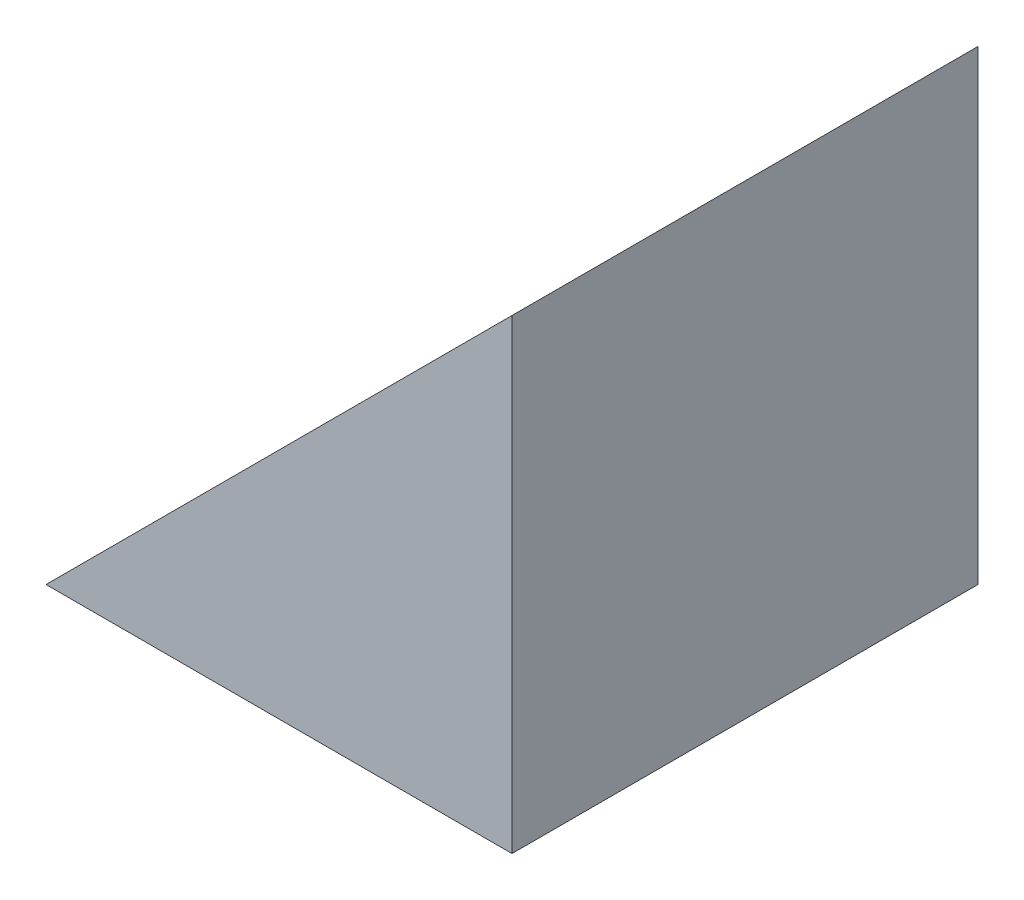
ISO-10303-21;
HEADER;
FILE_DESCRIPTION(('STEP AP214'),'2;1');
FILE_NAME('part.step','',(''),(''),'','','');
FILE_SCHEMA(('AUTOMOTIVE_DESIGN { 1 0 10303 214 1 1 1 1 }'));
ENDSEC;
DATA;
#1=APPLICATION_CONTEXT('core data for automotive mechanical design processes');
#2=APPLICATION_PROTOCOL_DEFINITION('international standard','automotive_design',2000,#1);
#3=PRODUCT_CONTEXT('',#1,'mechanical');
#4=PRODUCT('Part','Part','',(#3));
#5=PRODUCT_RELATED_PRODUCT_CATEGORY('part','',(#4));
#6=PRODUCT_DEFINITION_FORMATION('','',#4);
#7=PRODUCT_DEFINITION_CONTEXT('part definition',#1,'design');
#8=PRODUCT_DEFINITION('design','',#6,#7);
#9=PRODUCT_DEFINITION_SHAPE('','',#8);
#10=(LENGTH_UNIT() NAMED_UNIT(*) SI_UNIT(.MILLI.,.METRE.));
#11=(NAMED_UNIT(*) PLANE_ANGLE_UNIT() SI_UNIT($,.RADIAN.));
#12=(NAMED_UNIT(*) SI_UNIT($,.STERADIAN.) SOLID_ANGLE_UNIT());
#13=UNCERTAINTY_MEASURE_WITH_UNIT(LENGTH_MEASURE(1.E-05),#10,'distance_accuracy_value','');
#14=(GEOMETRIC_REPRESENTATION_CONTEXT(3) GLOBAL_UNCERTAINTY_ASSIGNED_CONTEXT((#13)) GLOBAL_UNIT_ASSIGNED_CONTEXT((#10,
#11,#12)) REPRESENTATION_CONTEXT('',''));
#15=CARTESIAN_POINT('',(0.,0.,0.));
#16=DIRECTION('',(0.,0.,1.));
#17=DIRECTION('',(1.,0.,0.));
#18=AXIS2_PLACEMENT_3D('',#15,#16,#17);
#19=CARTESIAN_POINT('',(174.714063710906,132.779070240306,50.));
#20=DIRECTION('',(0.,-1.,0.));
#21=DIRECTION('',(0.,0.,-1.));
#22=AXIS2_PLACEMENT_3D('',#19,#20,#21);
#23=PLANE('',#22);
#24=DIRECTION('',(-1.,0.,0.));
#25=VECTOR('',#24,1.);
#26=CARTESIAN_POINT('',(174.714063710906,132.779070240306,0.));
#27=LINE('',#26,#25);
#28=CARTESIAN_POINT('',(174.714063710906,132.779070240306,0.));
#29=VERTEX_POINT('',#28);
#30=CARTESIAN_POINT('',(124.714063710906,132.779070240306,0.));
#31=VERTEX_POINT('',#30);
#32=EDGE_CURVE('E87',#29,#31,#27,.T.);
#33=ORIENTED_EDGE('',*,*,#32,.F.);
#34=DIRECTION('',(0.,0.,-1.));
#35=VECTOR('',#34,1.);
#36=CARTESIAN_POINT('',(174.714063710906,132.779070240306,50.));
#37=LINE('',#36,#35);
#38=CARTESIAN_POINT('',(174.714063710906,132.779070240306,50.));
#39=VERTEX_POINT('',#38);
#40=EDGE_CURVE('E11',#39,#29,#37,.T.);
#41=ORIENTED_EDGE('',*,*,#40,.F.);
#42=DIRECTION('',(-1.,0.,0.));
#43=VECTOR('',#42,1.);
#44=CARTESIAN_POINT('',(174.714063710906,132.779070240306,50.));
#45=LINE('',#44,#43);
#46=CARTESIAN_POINT('',(124.714063710906,132.779070240306,50.));
#47=VERTEX_POINT('',#46);
#48=EDGE_CURVE('E80',#39,#47,#45,.T.);
#49=ORIENTED_EDGE('',*,*,#48,.T.);
#50=DIRECTION('',(0.,0.,-1.));
#51=VECTOR('',#50,1.);
#52=CARTESIAN_POINT('',(124.714063710906,132.779070240306,50.));
#53=LINE('',#52,#51);
#54=EDGE_CURVE('E38',#47,#31,#53,.T.);
#55=ORIENTED_EDGE('',*,*,#54,.T.);
#56=EDGE_LOOP('',(#33,#41,#49,#55));
#57=FACE_BOUND('',#56,.T.);
#58=ADVANCED_FACE('F35',(#57),#23,.T.);
#59=CARTESIAN_POINT('',(174.714063710906,132.779070240306,50.));
#60=DIRECTION('',(-1.,0.,0.));
#61=DIRECTION('',(0.,0.,1.));
#62=AXIS2_PLACEMENT_3D('',#59,#60,#61);
#63=PLANE('',#62);
#64=DIRECTION('',(0.,1.,0.));
#65=VECTOR('',#64,1.);
#66=CARTESIAN_POINT('',(174.714063710906,132.779070240306,0.));
#67=LINE('',#66,#65);
#68=CARTESIAN_POINT('',(174.714063710906,182.779070240306,0.));
#69=VERTEX_POINT('',#68);
#70=EDGE_CURVE('E82',#29,#69,#67,.T.);
#71=ORIENTED_EDGE('',*,*,#70,.T.);
#72=DIRECTION('',(0.,0.,-1.));
#73=VECTOR('',#72,1.);
#74=CARTESIAN_POINT('',(174.714063710906,182.779070240306,50.));
#75=LINE('',#74,#73);
#76=CARTESIAN_POINT('',(174.714063710906,182.779070240306,50.));
#77=VERTEX_POINT('',#76);
#78=EDGE_CURVE('E44',#77,#69,#75,.T.);
#79=ORIENTED_EDGE('',*,*,#78,.F.);
#80=DIRECTION('',(0.,1.,0.));
#81=VECTOR('',#80,1.);
#82=CARTESIAN_POINT('',(174.714063710906,132.779070240306,50.));
#83=LINE('',#82,#81);
#84=EDGE_CURVE('E76',#39,#77,#83,.T.);
#85=ORIENTED_EDGE('',*,*,#84,.F.);
#86=ORIENTED_EDGE('',*,*,#40,.T.);
#87=EDGE_LOOP('',(#71,#79,#85,#86));
#88=FACE_BOUND('',#87,.T.);
#89=ADVANCED_FACE('F91',(#88),#63,.F.);
#90=CARTESIAN_POINT('',(124.714063710906,132.779070240306,50.));
#91=DIRECTION('',(-0.707106781186548,0.707106781186547,0.));
#92=DIRECTION('',(-0.707106781186547,-0.707106781186548,0.));
#93=AXIS2_PLACEMENT_3D('',#90,#91,#92);
#94=PLANE('',#93);
#95=DIRECTION('',(0.707106781186547,0.707106781186548,0.));
#96=VECTOR('',#95,1.);
#97=CARTESIAN_POINT('',(124.714063710906,132.779070240306,0.));
#98=LINE('',#97,#96);
#99=EDGE_CURVE('E74',#31,#69,#98,.T.);
#100=ORIENTED_EDGE('',*,*,#99,.F.);
#101=ORIENTED_EDGE('',*,*,#54,.F.);
#102=DIRECTION('',(0.707106781186547,0.707106781186548,0.));
#103=VECTOR('',#102,1.);
#104=CARTESIAN_POINT('',(124.714063710906,132.779070240306,50.));
#105=LINE('',#104,#103);
#106=EDGE_CURVE('E72',#47,#77,#105,.T.);
#107=ORIENTED_EDGE('',*,*,#106,.T.);
#108=ORIENTED_EDGE('',*,*,#78,.T.);
#109=EDGE_LOOP('',(#100,#101,#107,#108));
#110=FACE_BOUND('',#109,.T.);
#111=ADVANCED_FACE('F71',(#110),#94,.T.);
#112=CARTESIAN_POINT('',(0.,0.,50.));
#113=DIRECTION('',(0.,0.,-1.));
#114=DIRECTION('',(-1.,0.,0.));
#115=AXIS2_PLACEMENT_3D('',#112,#113,#114);
#116=PLANE('',#115);
#117=ORIENTED_EDGE('',*,*,#48,.F.);
#118=ORIENTED_EDGE('',*,*,#84,.T.);
#119=ORIENTED_EDGE('',*,*,#106,.F.);
#120=EDGE_LOOP('',(#117,#118,#119));
#121=FACE_BOUND('',#120,.T.);
#122=ADVANCED_FACE('F79',(#121),#116,.F.);
#123=CARTESIAN_POINT('',(0.,0.,0.));
#124=DIRECTION('',(0.,0.,-1.));
#125=DIRECTION('',(-1.,0.,0.));
#126=AXIS2_PLACEMENT_3D('',#123,#124,#125);
#127=PLANE('',#126);
#128=ORIENTED_EDGE('',*,*,#32,.T.);
#129=ORIENTED_EDGE('',*,*,#99,.T.);
#130=ORIENTED_EDGE('',*,*,#70,.F.);
#131=EDGE_LOOP('',(#128,#129,#130));
#132=FACE_BOUND('',#131,.T.);
#133=ADVANCED_FACE('F90',(#132),#127,.T.);
#134=CLOSED_SHELL('',(#58,#89,#111,#122,#133));
#135=MANIFOLD_SOLID_BREP('B2',#134);
#136=ADVANCED_BREP_SHAPE_REPRESENTATION('',(#18,#135),#14);
#137=SHAPE_DEFINITION_REPRESENTATION(#9,#136);
ENDSEC;
END-ISO-10303-21;
